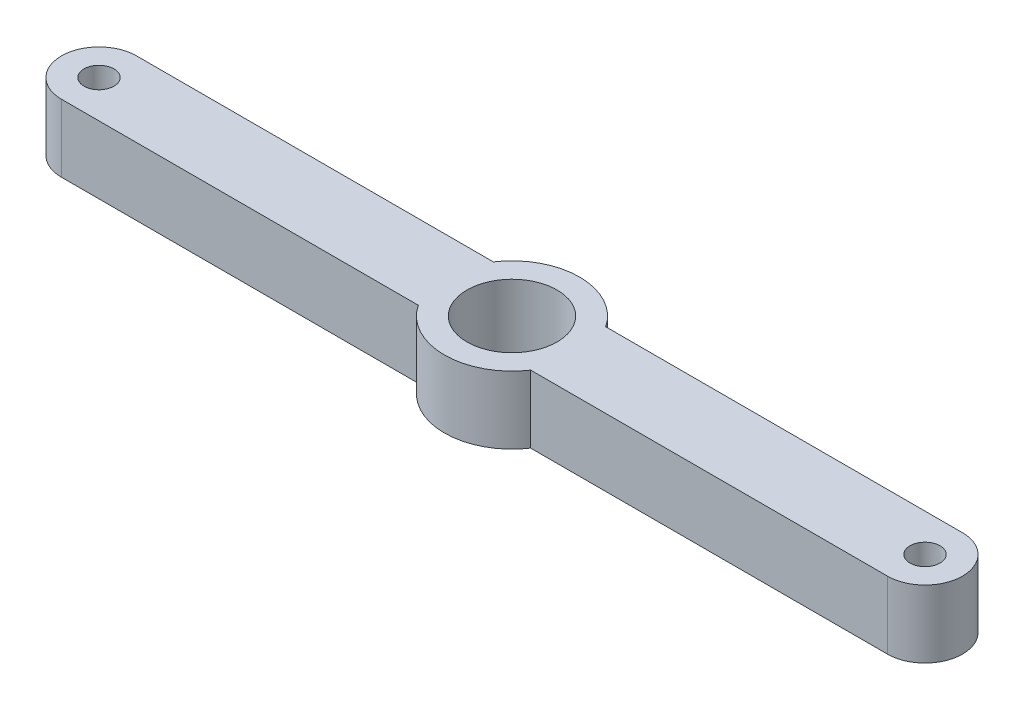
ISO-10303-21;
HEADER;
FILE_DESCRIPTION(('STEP AP214'),'2;1');
FILE_NAME('part.step','',(''),(''),'','','');
FILE_SCHEMA(('AUTOMOTIVE_DESIGN { 1 0 10303 214 1 1 1 1 }'));
ENDSEC;
DATA;
#1=APPLICATION_CONTEXT('core data for automotive mechanical design processes');
#2=APPLICATION_PROTOCOL_DEFINITION('international standard','automotive_design',2000,#1);
#3=PRODUCT_CONTEXT('',#1,'mechanical');
#4=PRODUCT('Part','Part','',(#3));
#5=PRODUCT_RELATED_PRODUCT_CATEGORY('part','',(#4));
#6=PRODUCT_DEFINITION_FORMATION('','',#4);
#7=PRODUCT_DEFINITION_CONTEXT('part definition',#1,'design');
#8=PRODUCT_DEFINITION('design','',#6,#7);
#9=PRODUCT_DEFINITION_SHAPE('','',#8);
#10=(LENGTH_UNIT() NAMED_UNIT(*) SI_UNIT(.MILLI.,.METRE.));
#11=(NAMED_UNIT(*) PLANE_ANGLE_UNIT() SI_UNIT($,.RADIAN.));
#12=(NAMED_UNIT(*) SI_UNIT($,.STERADIAN.) SOLID_ANGLE_UNIT());
#13=UNCERTAINTY_MEASURE_WITH_UNIT(LENGTH_MEASURE(1.E-05),#10,'distance_accuracy_value','');
#14=(GEOMETRIC_REPRESENTATION_CONTEXT(3) GLOBAL_UNCERTAINTY_ASSIGNED_CONTEXT((#13)) GLOBAL_UNIT_ASSIGNED_CONTEXT((#10,
#11,#12)) REPRESENTATION_CONTEXT('',''));
#15=CARTESIAN_POINT('',(0.,0.,0.));
#16=DIRECTION('',(0.,0.,1.));
#17=DIRECTION('',(1.,0.,0.));
#18=AXIS2_PLACEMENT_3D('',#15,#16,#17);
#19=CARTESIAN_POINT('',(-27.5,4.5,0.));
#20=DIRECTION('',(0.,-1.,0.));
#21=DIRECTION('',(0.,0.,-1.));
#22=AXIS2_PLACEMENT_3D('',#19,#20,#21);
#23=CYLINDRICAL_SURFACE('',#22,2.5);
#24=CARTESIAN_POINT('',(-27.5,0.,0.));
#25=DIRECTION('',(0.,1.,0.));
#26=DIRECTION('',(0.,0.,1.));
#27=AXIS2_PLACEMENT_3D('',#24,#25,#26);
#28=CIRCLE('',#27,2.5);
#29=CARTESIAN_POINT('',(-27.5,0.,-2.5));
#30=VERTEX_POINT('',#29);
#31=CARTESIAN_POINT('',(-27.5,0.,2.50000000000001));
#32=VERTEX_POINT('',#31);
#33=EDGE_CURVE('E145',#30,#32,#28,.T.);
#34=ORIENTED_EDGE('',*,*,#33,.T.);
#35=DIRECTION('',(0.,-1.,0.));
#36=VECTOR('',#35,1.);
#37=CARTESIAN_POINT('',(-27.5,4.5,2.50000000000001));
#38=LINE('',#37,#36);
#39=CARTESIAN_POINT('',(-27.5,4.5,2.50000000000001));
#40=VERTEX_POINT('',#39);
#41=EDGE_CURVE('E11',#40,#32,#38,.T.);
#42=ORIENTED_EDGE('',*,*,#41,.F.);
#43=CARTESIAN_POINT('',(-27.5,4.5,0.));
#44=DIRECTION('',(0.,1.,0.));
#45=DIRECTION('',(0.,0.,1.));
#46=AXIS2_PLACEMENT_3D('',#43,#44,#45);
#47=CIRCLE('',#46,2.5);
#48=CARTESIAN_POINT('',(-27.5,4.5,-2.5));
#49=VERTEX_POINT('',#48);
#50=EDGE_CURVE('E160',#49,#40,#47,.T.);
#51=ORIENTED_EDGE('',*,*,#50,.F.);
#52=DIRECTION('',(0.,-1.,0.));
#53=VECTOR('',#52,1.);
#54=CARTESIAN_POINT('',(-27.5,4.5,-2.5));
#55=LINE('',#54,#53);
#56=EDGE_CURVE('E141',#49,#30,#55,.T.);
#57=ORIENTED_EDGE('',*,*,#56,.T.);
#58=EDGE_LOOP('',(#34,#42,#51,#57));
#59=FACE_BOUND('',#58,.T.);
#60=ADVANCED_FACE('F47',(#59),#23,.T.);
#61=CARTESIAN_POINT('',(-3.74165738677395,4.5,2.5));
#62=DIRECTION('',(0.,0.,-1.));
#63=DIRECTION('',(-1.,0.,0.));
#64=AXIS2_PLACEMENT_3D('',#61,#62,#63);
#65=PLANE('',#64);
#66=DIRECTION('',(1.,0.,0.));
#67=VECTOR('',#66,1.);
#68=CARTESIAN_POINT('',(-3.74165738677395,0.,2.5));
#69=LINE('',#68,#67);
#70=CARTESIAN_POINT('',(-3.74165738677395,0.,2.5));
#71=VERTEX_POINT('',#70);
#72=EDGE_CURVE('E148',#32,#71,#69,.T.);
#73=ORIENTED_EDGE('',*,*,#72,.T.);
#74=DIRECTION('',(0.,-1.,0.));
#75=VECTOR('',#74,1.);
#76=CARTESIAN_POINT('',(-3.74165738677395,4.5,2.5));
#77=LINE('',#76,#75);
#78=CARTESIAN_POINT('',(-3.74165738677395,4.5,2.5));
#79=VERTEX_POINT('',#78);
#80=EDGE_CURVE('E56',#79,#71,#77,.T.);
#81=ORIENTED_EDGE('',*,*,#80,.F.);
#82=DIRECTION('',(1.,0.,0.));
#83=VECTOR('',#82,1.);
#84=CARTESIAN_POINT('',(-3.74165738677395,4.5,2.5));
#85=LINE('',#84,#83);
#86=EDGE_CURVE('E108',#40,#79,#85,.T.);
#87=ORIENTED_EDGE('',*,*,#86,.F.);
#88=ORIENTED_EDGE('',*,*,#41,.T.);
#89=EDGE_LOOP('',(#73,#81,#87,#88));
#90=FACE_BOUND('',#89,.T.);
#91=ADVANCED_FACE('F225',(#90),#65,.F.);
#92=CARTESIAN_POINT('',(0.,4.5,0.));
#93=DIRECTION('',(0.,-1.,0.));
#94=DIRECTION('',(0.,0.,-1.));
#95=AXIS2_PLACEMENT_3D('',#92,#93,#94);
#96=CYLINDRICAL_SURFACE('',#95,4.5);
#97=CARTESIAN_POINT('',(0.,0.,0.));
#98=DIRECTION('',(0.,1.,0.));
#99=DIRECTION('',(0.,0.,1.));
#100=AXIS2_PLACEMENT_3D('',#97,#98,#99);
#101=CIRCLE('',#100,4.5);
#102=CARTESIAN_POINT('',(3.74165738677393,0.,2.5));
#103=VERTEX_POINT('',#102);
#104=EDGE_CURVE('E151',#71,#103,#101,.T.);
#105=ORIENTED_EDGE('',*,*,#104,.T.);
#106=DIRECTION('',(0.,-1.,0.));
#107=VECTOR('',#106,1.);
#108=CARTESIAN_POINT('',(3.74165738677393,4.5,2.5));
#109=LINE('',#108,#107);
#110=CARTESIAN_POINT('',(3.74165738677393,4.5,2.5));
#111=VERTEX_POINT('',#110);
#112=EDGE_CURVE('E167',#111,#103,#109,.T.);
#113=ORIENTED_EDGE('',*,*,#112,.F.);
#114=CARTESIAN_POINT('',(0.,4.5,0.));
#115=DIRECTION('',(0.,1.,0.));
#116=DIRECTION('',(0.,0.,1.));
#117=AXIS2_PLACEMENT_3D('',#114,#115,#116);
#118=CIRCLE('',#117,4.5);
#119=EDGE_CURVE('E192',#79,#111,#118,.T.);
#120=ORIENTED_EDGE('',*,*,#119,.F.);
#121=ORIENTED_EDGE('',*,*,#80,.T.);
#122=EDGE_LOOP('',(#105,#113,#120,#121));
#123=FACE_BOUND('',#122,.T.);
#124=ADVANCED_FACE('F230',(#123),#96,.T.);
#125=CARTESIAN_POINT('',(27.5,4.5,2.5));
#126=DIRECTION('',(0.,0.,-1.));
#127=DIRECTION('',(-1.,0.,0.));
#128=AXIS2_PLACEMENT_3D('',#125,#126,#127);
#129=PLANE('',#128);
#130=DIRECTION('',(1.,0.,0.));
#131=VECTOR('',#130,1.);
#132=CARTESIAN_POINT('',(27.5,0.,2.5));
#133=LINE('',#132,#131);
#134=CARTESIAN_POINT('',(27.5,0.,2.5));
#135=VERTEX_POINT('',#134);
#136=EDGE_CURVE('E153',#103,#135,#133,.T.);
#137=ORIENTED_EDGE('',*,*,#136,.T.);
#138=DIRECTION('',(0.,-1.,0.));
#139=VECTOR('',#138,1.);
#140=CARTESIAN_POINT('',(27.5,4.5,2.5));
#141=LINE('',#140,#139);
#142=CARTESIAN_POINT('',(27.5,4.5,2.5));
#143=VERTEX_POINT('',#142);
#144=EDGE_CURVE('E164',#143,#135,#141,.T.);
#145=ORIENTED_EDGE('',*,*,#144,.F.);
#146=DIRECTION('',(1.,0.,0.));
#147=VECTOR('',#146,1.);
#148=CARTESIAN_POINT('',(27.5,4.5,2.5));
#149=LINE('',#148,#147);
#150=EDGE_CURVE('E194',#111,#143,#149,.T.);
#151=ORIENTED_EDGE('',*,*,#150,.F.);
#152=ORIENTED_EDGE('',*,*,#112,.T.);
#153=EDGE_LOOP('',(#137,#145,#151,#152));
#154=FACE_BOUND('',#153,.T.);
#155=ADVANCED_FACE('F200',(#154),#129,.F.);
#156=CARTESIAN_POINT('',(27.5,4.5,0.));
#157=DIRECTION('',(0.,-1.,0.));
#158=DIRECTION('',(0.,0.,-1.));
#159=AXIS2_PLACEMENT_3D('',#156,#157,#158);
#160=CYLINDRICAL_SURFACE('',#159,2.5);
#161=CARTESIAN_POINT('',(27.5,0.,0.));
#162=DIRECTION('',(0.,1.,0.));
#163=DIRECTION('',(0.,0.,-1.));
#164=AXIS2_PLACEMENT_3D('',#161,#162,#163);
#165=CIRCLE('',#164,2.5);
#166=CARTESIAN_POINT('',(27.5,0.,-2.5));
#167=VERTEX_POINT('',#166);
#168=EDGE_CURVE('E155',#135,#167,#165,.T.);
#169=ORIENTED_EDGE('',*,*,#168,.T.);
#170=DIRECTION('',(0.,-1.,0.));
#171=VECTOR('',#170,1.);
#172=CARTESIAN_POINT('',(27.5,4.5,-2.5));
#173=LINE('',#172,#171);
#174=CARTESIAN_POINT('',(27.5,4.5,-2.5));
#175=VERTEX_POINT('',#174);
#176=EDGE_CURVE('E136',#175,#167,#173,.T.);
#177=ORIENTED_EDGE('',*,*,#176,.F.);
#178=CARTESIAN_POINT('',(27.5,4.5,0.));
#179=DIRECTION('',(0.,1.,0.));
#180=DIRECTION('',(0.,0.,-1.));
#181=AXIS2_PLACEMENT_3D('',#178,#179,#180);
#182=CIRCLE('',#181,2.5);
#183=EDGE_CURVE('E127',#143,#175,#182,.T.);
#184=ORIENTED_EDGE('',*,*,#183,.F.);
#185=ORIENTED_EDGE('',*,*,#144,.T.);
#186=EDGE_LOOP('',(#169,#177,#184,#185));
#187=FACE_BOUND('',#186,.T.);
#188=ADVANCED_FACE('F204',(#187),#160,.T.);
#189=CARTESIAN_POINT('',(27.5,4.5,-2.5));
#190=DIRECTION('',(0.,0.,1.));
#191=DIRECTION('',(1.,0.,0.));
#192=AXIS2_PLACEMENT_3D('',#189,#190,#191);
#193=PLANE('',#192);
#194=DIRECTION('',(-1.,0.,0.));
#195=VECTOR('',#194,1.);
#196=CARTESIAN_POINT('',(27.5,0.,-2.5));
#197=LINE('',#196,#195);
#198=CARTESIAN_POINT('',(3.74165738677394,0.,-2.5));
#199=VERTEX_POINT('',#198);
#200=EDGE_CURVE('E135',#167,#199,#197,.T.);
#201=ORIENTED_EDGE('',*,*,#200,.T.);
#202=DIRECTION('',(0.,-1.,0.));
#203=VECTOR('',#202,1.);
#204=CARTESIAN_POINT('',(3.74165738677394,4.5,-2.5));
#205=LINE('',#204,#203);
#206=CARTESIAN_POINT('',(3.74165738677394,4.5,-2.5));
#207=VERTEX_POINT('',#206);
#208=EDGE_CURVE('E132',#207,#199,#205,.T.);
#209=ORIENTED_EDGE('',*,*,#208,.F.);
#210=DIRECTION('',(-1.,0.,0.));
#211=VECTOR('',#210,1.);
#212=CARTESIAN_POINT('',(27.5,4.5,-2.5));
#213=LINE('',#212,#211);
#214=EDGE_CURVE('E121',#175,#207,#213,.T.);
#215=ORIENTED_EDGE('',*,*,#214,.F.);
#216=ORIENTED_EDGE('',*,*,#176,.T.);
#217=EDGE_LOOP('',(#201,#209,#215,#216));
#218=FACE_BOUND('',#217,.T.);
#219=ADVANCED_FACE('F133',(#218),#193,.F.);
#220=CARTESIAN_POINT('',(0.,4.5,0.));
#221=DIRECTION('',(0.,-1.,0.));
#222=DIRECTION('',(0.,0.,-1.));
#223=AXIS2_PLACEMENT_3D('',#220,#221,#222);
#224=CYLINDRICAL_SURFACE('',#223,4.5);
#225=CARTESIAN_POINT('',(0.,0.,0.));
#226=DIRECTION('',(0.,1.,0.));
#227=DIRECTION('',(0.,0.,1.));
#228=AXIS2_PLACEMENT_3D('',#225,#226,#227);
#229=CIRCLE('',#228,4.5);
#230=CARTESIAN_POINT('',(-3.74165738677395,0.,-2.5));
#231=VERTEX_POINT('',#230);
#232=EDGE_CURVE('E94',#199,#231,#229,.T.);
#233=ORIENTED_EDGE('',*,*,#232,.T.);
#234=DIRECTION('',(0.,-1.,0.));
#235=VECTOR('',#234,1.);
#236=CARTESIAN_POINT('',(-3.74165738677395,4.5,-2.5));
#237=LINE('',#236,#235);
#238=CARTESIAN_POINT('',(-3.74165738677395,4.5,-2.5));
#239=VERTEX_POINT('',#238);
#240=EDGE_CURVE('E137',#239,#231,#237,.T.);
#241=ORIENTED_EDGE('',*,*,#240,.F.);
#242=CARTESIAN_POINT('',(0.,4.5,0.));
#243=DIRECTION('',(0.,1.,0.));
#244=DIRECTION('',(0.,0.,1.));
#245=AXIS2_PLACEMENT_3D('',#242,#243,#244);
#246=CIRCLE('',#245,4.5);
#247=EDGE_CURVE('E125',#207,#239,#246,.T.);
#248=ORIENTED_EDGE('',*,*,#247,.F.);
#249=ORIENTED_EDGE('',*,*,#208,.T.);
#250=EDGE_LOOP('',(#233,#241,#248,#249));
#251=FACE_BOUND('',#250,.T.);
#252=ADVANCED_FACE('F139',(#251),#224,.T.);
#253=CARTESIAN_POINT('',(-3.74165738677395,4.5,-2.5));
#254=DIRECTION('',(0.,0.,1.));
#255=DIRECTION('',(1.,0.,0.));
#256=AXIS2_PLACEMENT_3D('',#253,#254,#255);
#257=PLANE('',#256);
#258=DIRECTION('',(-1.,0.,0.));
#259=VECTOR('',#258,1.);
#260=CARTESIAN_POINT('',(-3.74165738677395,0.,-2.5));
#261=LINE('',#260,#259);
#262=EDGE_CURVE('E100',#231,#30,#261,.T.);
#263=ORIENTED_EDGE('',*,*,#262,.T.);
#264=ORIENTED_EDGE('',*,*,#56,.F.);
#265=DIRECTION('',(-1.,0.,0.));
#266=VECTOR('',#265,1.);
#267=CARTESIAN_POINT('',(-3.74165738677395,4.5,-2.5));
#268=LINE('',#267,#266);
#269=EDGE_CURVE('E65',#239,#49,#268,.T.);
#270=ORIENTED_EDGE('',*,*,#269,.F.);
#271=ORIENTED_EDGE('',*,*,#240,.T.);
#272=EDGE_LOOP('',(#263,#264,#270,#271));
#273=FACE_BOUND('',#272,.T.);
#274=ADVANCED_FACE('F212',(#273),#257,.F.);
#275=CARTESIAN_POINT('',(-27.5,4.5,0.));
#276=DIRECTION('',(0.,1.,0.));
#277=DIRECTION('',(0.,0.,1.));
#278=AXIS2_PLACEMENT_3D('',#275,#276,#277);
#279=PLANE('',#278);
#280=CARTESIAN_POINT('',(-27.5,4.5,0.));
#281=DIRECTION('',(0.,1.,0.));
#282=DIRECTION('',(0.,0.,1.));
#283=AXIS2_PLACEMENT_3D('',#280,#281,#282);
#284=CIRCLE('',#283,1.);
#285=CARTESIAN_POINT('',(-27.5,4.5,1.));
#286=VERTEX_POINT('',#285);
#287=EDGE_CURVE('E176',#286,#286,#284,.T.);
#288=ORIENTED_EDGE('',*,*,#287,.F.);
#289=EDGE_LOOP('',(#288));
#290=FACE_BOUND('',#289,.T.);
#291=CARTESIAN_POINT('',(27.5,4.5,0.));
#292=DIRECTION('',(0.,1.,0.));
#293=DIRECTION('',(0.,0.,-1.));
#294=AXIS2_PLACEMENT_3D('',#291,#292,#293);
#295=CIRCLE('',#294,1.);
#296=CARTESIAN_POINT('',(27.5,4.5,-1.));
#297=VERTEX_POINT('',#296);
#298=EDGE_CURVE('E181',#297,#297,#295,.T.);
#299=ORIENTED_EDGE('',*,*,#298,.F.);
#300=EDGE_LOOP('',(#299));
#301=FACE_BOUND('',#300,.T.);
#302=CARTESIAN_POINT('',(0.,4.5,0.));
#303=DIRECTION('',(0.,1.,0.));
#304=DIRECTION('',(0.,0.,1.));
#305=AXIS2_PLACEMENT_3D('',#302,#303,#304);
#306=CIRCLE('',#305,3.);
#307=CARTESIAN_POINT('',(0.,4.5,3.));
#308=VERTEX_POINT('',#307);
#309=EDGE_CURVE('E173',#308,#308,#306,.T.);
#310=ORIENTED_EDGE('',*,*,#309,.F.);
#311=EDGE_LOOP('',(#310));
#312=FACE_BOUND('',#311,.T.);
#313=ORIENTED_EDGE('',*,*,#50,.T.);
#314=ORIENTED_EDGE('',*,*,#86,.T.);
#315=ORIENTED_EDGE('',*,*,#119,.T.);
#316=ORIENTED_EDGE('',*,*,#150,.T.);
#317=ORIENTED_EDGE('',*,*,#183,.T.);
#318=ORIENTED_EDGE('',*,*,#214,.T.);
#319=ORIENTED_EDGE('',*,*,#247,.T.);
#320=ORIENTED_EDGE('',*,*,#269,.T.);
#321=EDGE_LOOP('',(#313,#314,#315,#316,#317,#318,#319,#320));
#322=FACE_BOUND('',#321,.T.);
#323=ADVANCED_FACE('F123',(#290,#301,#312,#322),#279,.T.);
#324=CARTESIAN_POINT('',(-27.5,0.,0.));
#325=DIRECTION('',(0.,1.,0.));
#326=DIRECTION('',(0.,0.,1.));
#327=AXIS2_PLACEMENT_3D('',#324,#325,#326);
#328=PLANE('',#327);
#329=CARTESIAN_POINT('',(-27.5,0.,0.));
#330=DIRECTION('',(0.,1.,0.));
#331=DIRECTION('',(0.,0.,1.));
#332=AXIS2_PLACEMENT_3D('',#329,#330,#331);
#333=CIRCLE('',#332,1.);
#334=CARTESIAN_POINT('',(-27.5,0.,1.));
#335=VERTEX_POINT('',#334);
#336=EDGE_CURVE('E50',#335,#335,#333,.T.);
#337=ORIENTED_EDGE('',*,*,#336,.T.);
#338=EDGE_LOOP('',(#337));
#339=FACE_BOUND('',#338,.T.);
#340=CARTESIAN_POINT('',(27.5,0.,0.));
#341=DIRECTION('',(0.,1.,0.));
#342=DIRECTION('',(0.,0.,1.));
#343=AXIS2_PLACEMENT_3D('',#340,#341,#342);
#344=CIRCLE('',#343,1.);
#345=CARTESIAN_POINT('',(27.5,0.,1.));
#346=VERTEX_POINT('',#345);
#347=EDGE_CURVE('E174',#346,#346,#344,.T.);
#348=ORIENTED_EDGE('',*,*,#347,.T.);
#349=EDGE_LOOP('',(#348));
#350=FACE_BOUND('',#349,.T.);
#351=CARTESIAN_POINT('',(0.,0.,0.));
#352=DIRECTION('',(0.,1.,0.));
#353=DIRECTION('',(0.,0.,1.));
#354=AXIS2_PLACEMENT_3D('',#351,#352,#353);
#355=CIRCLE('',#354,3.);
#356=CARTESIAN_POINT('',(0.,0.,3.));
#357=VERTEX_POINT('',#356);
#358=EDGE_CURVE('E149',#357,#357,#355,.T.);
#359=ORIENTED_EDGE('',*,*,#358,.T.);
#360=EDGE_LOOP('',(#359));
#361=FACE_BOUND('',#360,.T.);
#362=ORIENTED_EDGE('',*,*,#33,.F.);
#363=ORIENTED_EDGE('',*,*,#262,.F.);
#364=ORIENTED_EDGE('',*,*,#232,.F.);
#365=ORIENTED_EDGE('',*,*,#200,.F.);
#366=ORIENTED_EDGE('',*,*,#168,.F.);
#367=ORIENTED_EDGE('',*,*,#136,.F.);
#368=ORIENTED_EDGE('',*,*,#104,.F.);
#369=ORIENTED_EDGE('',*,*,#72,.F.);
#370=EDGE_LOOP('',(#362,#363,#364,#365,#366,#367,#368,#369));
#371=FACE_BOUND('',#370,.T.);
#372=ADVANCED_FACE('F207',(#339,#350,#361,#371),#328,.F.);
#373=CARTESIAN_POINT('',(0.,-1.2E-05,0.));
#374=DIRECTION('',(0.,1.,0.));
#375=DIRECTION('',(0.,0.,1.));
#376=AXIS2_PLACEMENT_3D('',#373,#374,#375);
#377=CYLINDRICAL_SURFACE('',#376,3.);
#378=ORIENTED_EDGE('',*,*,#309,.T.);
#379=EDGE_LOOP('',(#378));
#380=FACE_BOUND('',#379,.T.);
#381=ORIENTED_EDGE('',*,*,#358,.F.);
#382=EDGE_LOOP('',(#381));
#383=FACE_BOUND('',#382,.T.);
#384=ADVANCED_FACE('F249',(#380,#383),#377,.F.);
#385=CARTESIAN_POINT('',(27.5,-1.2E-05,0.));
#386=DIRECTION('',(0.,1.,0.));
#387=DIRECTION('',(0.,0.,1.));
#388=AXIS2_PLACEMENT_3D('',#385,#386,#387);
#389=CYLINDRICAL_SURFACE('',#388,1.);
#390=ORIENTED_EDGE('',*,*,#298,.T.);
#391=EDGE_LOOP('',(#390));
#392=FACE_BOUND('',#391,.T.);
#393=ORIENTED_EDGE('',*,*,#347,.F.);
#394=EDGE_LOOP('',(#393));
#395=FACE_BOUND('',#394,.T.);
#396=ADVANCED_FACE('F254',(#392,#395),#389,.F.);
#397=CARTESIAN_POINT('',(-27.5,-1.2E-05,0.));
#398=DIRECTION('',(0.,1.,0.));
#399=DIRECTION('',(0.,0.,1.));
#400=AXIS2_PLACEMENT_3D('',#397,#398,#399);
#401=CYLINDRICAL_SURFACE('',#400,1.);
#402=ORIENTED_EDGE('',*,*,#287,.T.);
#403=EDGE_LOOP('',(#402));
#404=FACE_BOUND('',#403,.T.);
#405=ORIENTED_EDGE('',*,*,#336,.F.);
#406=EDGE_LOOP('',(#405));
#407=FACE_BOUND('',#406,.T.);
#408=ADVANCED_FACE('F271',(#404,#407),#401,.F.);
#409=CLOSED_SHELL('',(#60,#91,#124,#155,#188,#219,#252,#274,#323,#372,#384,#396,#408));
#410=MANIFOLD_SOLID_BREP('B2',#409);
#411=ADVANCED_BREP_SHAPE_REPRESENTATION('',(#18,#410),#14);
#412=SHAPE_DEFINITION_REPRESENTATION(#9,#411);
ENDSEC;
END-ISO-10303-21;
